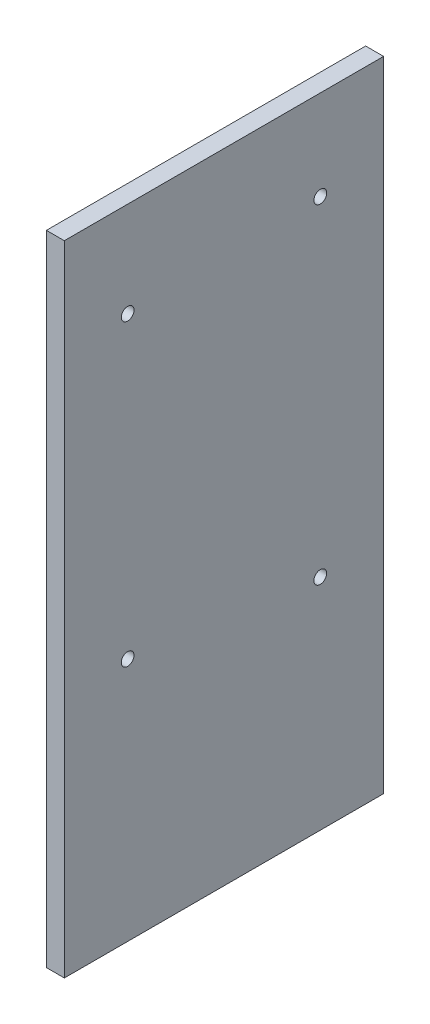
ISO-10303-21;
HEADER;
FILE_DESCRIPTION(('STEP AP214'),'2;1');
FILE_NAME('part.step','',(''),(''),'','','');
FILE_SCHEMA(('AUTOMOTIVE_DESIGN { 1 0 10303 214 1 1 1 1 }'));
ENDSEC;
DATA;
#1=APPLICATION_CONTEXT('core data for automotive mechanical design processes');
#2=APPLICATION_PROTOCOL_DEFINITION('international standard','automotive_design',2000,#1);
#3=PRODUCT_CONTEXT('',#1,'mechanical');
#4=PRODUCT('Part','Part','',(#3));
#5=PRODUCT_RELATED_PRODUCT_CATEGORY('part','',(#4));
#6=PRODUCT_DEFINITION_FORMATION('','',#4);
#7=PRODUCT_DEFINITION_CONTEXT('part definition',#1,'design');
#8=PRODUCT_DEFINITION('design','',#6,#7);
#9=PRODUCT_DEFINITION_SHAPE('','',#8);
#10=(LENGTH_UNIT() NAMED_UNIT(*) SI_UNIT(.MILLI.,.METRE.));
#11=(NAMED_UNIT(*) PLANE_ANGLE_UNIT() SI_UNIT($,.RADIAN.));
#12=(NAMED_UNIT(*) SI_UNIT($,.STERADIAN.) SOLID_ANGLE_UNIT());
#13=UNCERTAINTY_MEASURE_WITH_UNIT(LENGTH_MEASURE(1.E-05),#10,'distance_accuracy_value','');
#14=(GEOMETRIC_REPRESENTATION_CONTEXT(3) GLOBAL_UNCERTAINTY_ASSIGNED_CONTEXT((#13)) GLOBAL_UNIT_ASSIGNED_CONTEXT((#10,
#11,#12)) REPRESENTATION_CONTEXT('',''));
#15=CARTESIAN_POINT('',(0.,0.,0.));
#16=DIRECTION('',(0.,0.,1.));
#17=DIRECTION('',(1.,0.,0.));
#18=AXIS2_PLACEMENT_3D('',#15,#16,#17);
#19=CARTESIAN_POINT('',(4.5,-80.,-40.));
#20=DIRECTION('',(0.,0.,1.));
#21=DIRECTION('',(1.,0.,0.));
#22=AXIS2_PLACEMENT_3D('',#19,#20,#21);
#23=PLANE('',#22);
#24=DIRECTION('',(0.,1.,0.));
#25=VECTOR('',#24,1.);
#26=CARTESIAN_POINT('',(0.,-80.,-40.));
#27=LINE('',#26,#25);
#28=CARTESIAN_POINT('',(0.,-80.,-40.));
#29=VERTEX_POINT('',#28);
#30=CARTESIAN_POINT('',(0.,80.,-40.));
#31=VERTEX_POINT('',#30);
#32=EDGE_CURVE('E98',#29,#31,#27,.T.);
#33=ORIENTED_EDGE('',*,*,#32,.T.);
#34=DIRECTION('',(-1.,0.,0.));
#35=VECTOR('',#34,1.);
#36=CARTESIAN_POINT('',(4.5,80.,-40.));
#37=LINE('',#36,#35);
#38=CARTESIAN_POINT('',(4.5,80.,-40.));
#39=VERTEX_POINT('',#38);
#40=EDGE_CURVE('E11',#39,#31,#37,.T.);
#41=ORIENTED_EDGE('',*,*,#40,.F.);
#42=DIRECTION('',(0.,1.,0.));
#43=VECTOR('',#42,1.);
#44=CARTESIAN_POINT('',(4.5,-80.,-40.));
#45=LINE('',#44,#43);
#46=CARTESIAN_POINT('',(4.5,-80.,-40.));
#47=VERTEX_POINT('',#46);
#48=EDGE_CURVE('E86',#47,#39,#45,.T.);
#49=ORIENTED_EDGE('',*,*,#48,.F.);
#50=DIRECTION('',(-1.,0.,0.));
#51=VECTOR('',#50,1.);
#52=CARTESIAN_POINT('',(4.5,-80.,-40.));
#53=LINE('',#52,#51);
#54=EDGE_CURVE('E94',#47,#29,#53,.T.);
#55=ORIENTED_EDGE('',*,*,#54,.T.);
#56=EDGE_LOOP('',(#33,#41,#49,#55));
#57=FACE_BOUND('',#56,.T.);
#58=ADVANCED_FACE('F35',(#57),#23,.F.);
#59=CARTESIAN_POINT('',(4.5,80.,40.));
#60=DIRECTION('',(0.,-1.,0.));
#61=DIRECTION('',(0.,0.,-1.));
#62=AXIS2_PLACEMENT_3D('',#59,#60,#61);
#63=PLANE('',#62);
#64=DIRECTION('',(0.,0.,1.));
#65=VECTOR('',#64,1.);
#66=CARTESIAN_POINT('',(0.,80.,40.));
#67=LINE('',#66,#65);
#68=CARTESIAN_POINT('',(0.,80.,40.));
#69=VERTEX_POINT('',#68);
#70=EDGE_CURVE('E90',#31,#69,#67,.T.);
#71=ORIENTED_EDGE('',*,*,#70,.T.);
#72=DIRECTION('',(-1.,0.,0.));
#73=VECTOR('',#72,1.);
#74=CARTESIAN_POINT('',(4.5,80.,40.));
#75=LINE('',#74,#73);
#76=CARTESIAN_POINT('',(4.5,80.,40.));
#77=VERTEX_POINT('',#76);
#78=EDGE_CURVE('E43',#77,#69,#75,.T.);
#79=ORIENTED_EDGE('',*,*,#78,.F.);
#80=DIRECTION('',(0.,0.,1.));
#81=VECTOR('',#80,1.);
#82=CARTESIAN_POINT('',(4.5,80.,40.));
#83=LINE('',#82,#81);
#84=EDGE_CURVE('E81',#39,#77,#83,.T.);
#85=ORIENTED_EDGE('',*,*,#84,.F.);
#86=ORIENTED_EDGE('',*,*,#40,.T.);
#87=EDGE_LOOP('',(#71,#79,#85,#86));
#88=FACE_BOUND('',#87,.T.);
#89=ADVANCED_FACE('F89',(#88),#63,.F.);
#90=CARTESIAN_POINT('',(4.5,-80.,40.));
#91=DIRECTION('',(0.,0.,-1.));
#92=DIRECTION('',(-1.,0.,0.));
#93=AXIS2_PLACEMENT_3D('',#90,#91,#92);
#94=PLANE('',#93);
#95=DIRECTION('',(0.,-1.,0.));
#96=VECTOR('',#95,1.);
#97=CARTESIAN_POINT('',(0.,-80.,40.));
#98=LINE('',#97,#96);
#99=CARTESIAN_POINT('',(0.,-80.,40.));
#100=VERTEX_POINT('',#99);
#101=EDGE_CURVE('E68',#69,#100,#98,.T.);
#102=ORIENTED_EDGE('',*,*,#101,.T.);
#103=DIRECTION('',(-1.,0.,0.));
#104=VECTOR('',#103,1.);
#105=CARTESIAN_POINT('',(4.5,-80.,40.));
#106=LINE('',#105,#104);
#107=CARTESIAN_POINT('',(4.5,-80.,40.));
#108=VERTEX_POINT('',#107);
#109=EDGE_CURVE('E91',#108,#100,#106,.T.);
#110=ORIENTED_EDGE('',*,*,#109,.F.);
#111=DIRECTION('',(0.,-1.,0.));
#112=VECTOR('',#111,1.);
#113=CARTESIAN_POINT('',(4.5,-80.,40.));
#114=LINE('',#113,#112);
#115=EDGE_CURVE('E84',#77,#108,#114,.T.);
#116=ORIENTED_EDGE('',*,*,#115,.F.);
#117=ORIENTED_EDGE('',*,*,#78,.T.);
#118=EDGE_LOOP('',(#102,#110,#116,#117));
#119=FACE_BOUND('',#118,.T.);
#120=ADVANCED_FACE('F92',(#119),#94,.F.);
#121=CARTESIAN_POINT('',(4.5,-80.,40.));
#122=DIRECTION('',(0.,1.,0.));
#123=DIRECTION('',(0.,0.,1.));
#124=AXIS2_PLACEMENT_3D('',#121,#122,#123);
#125=PLANE('',#124);
#126=DIRECTION('',(0.,0.,-1.));
#127=VECTOR('',#126,1.);
#128=CARTESIAN_POINT('',(0.,-80.,40.));
#129=LINE('',#128,#127);
#130=EDGE_CURVE('E74',#100,#29,#129,.T.);
#131=ORIENTED_EDGE('',*,*,#130,.T.);
#132=ORIENTED_EDGE('',*,*,#54,.F.);
#133=DIRECTION('',(0.,0.,-1.));
#134=VECTOR('',#133,1.);
#135=CARTESIAN_POINT('',(4.5,-80.,40.));
#136=LINE('',#135,#134);
#137=EDGE_CURVE('E51',#108,#47,#136,.T.);
#138=ORIENTED_EDGE('',*,*,#137,.F.);
#139=ORIENTED_EDGE('',*,*,#109,.T.);
#140=EDGE_LOOP('',(#131,#132,#138,#139));
#141=FACE_BOUND('',#140,.T.);
#142=ADVANCED_FACE('F106',(#141),#125,.F.);
#143=CARTESIAN_POINT('',(4.5,0.,0.));
#144=DIRECTION('',(-1.,0.,0.));
#145=DIRECTION('',(0.,0.,1.));
#146=AXIS2_PLACEMENT_3D('',#143,#144,#145);
#147=PLANE('',#146);
#148=CARTESIAN_POINT('',(4.5,-25.05,-24.12));
#149=DIRECTION('',(-1.,0.,0.));
#150=DIRECTION('',(0.,0.,1.));
#151=AXIS2_PLACEMENT_3D('',#148,#149,#150);
#152=CIRCLE('',#151,1.6);
#153=CARTESIAN_POINT('',(4.5,-25.05,-22.52));
#154=VERTEX_POINT('',#153);
#155=EDGE_CURVE('E121',#154,#154,#152,.T.);
#156=ORIENTED_EDGE('',*,*,#155,.T.);
#157=EDGE_LOOP('',(#156));
#158=FACE_BOUND('',#157,.T.);
#159=CARTESIAN_POINT('',(4.5,-18.7,24.14));
#160=DIRECTION('',(-1.,0.,0.));
#161=DIRECTION('',(0.,0.,1.));
#162=AXIS2_PLACEMENT_3D('',#159,#160,#161);
#163=CIRCLE('',#162,1.6);
#164=CARTESIAN_POINT('',(4.5,-18.7,25.74));
#165=VERTEX_POINT('',#164);
#166=EDGE_CURVE('E127',#165,#165,#163,.T.);
#167=ORIENTED_EDGE('',*,*,#166,.T.);
#168=EDGE_LOOP('',(#167));
#169=FACE_BOUND('',#168,.T.);
#170=CARTESIAN_POINT('',(4.5,56.23,24.14));
#171=DIRECTION('',(-1.,0.,0.));
#172=DIRECTION('',(0.,0.,1.));
#173=AXIS2_PLACEMENT_3D('',#170,#171,#172);
#174=CIRCLE('',#173,1.60000000000001);
#175=CARTESIAN_POINT('',(4.5,56.23,25.74));
#176=VERTEX_POINT('',#175);
#177=EDGE_CURVE('E115',#176,#176,#174,.T.);
#178=ORIENTED_EDGE('',*,*,#177,.T.);
#179=EDGE_LOOP('',(#178));
#180=FACE_BOUND('',#179,.T.);
#181=CARTESIAN_POINT('',(4.5,57.5,-24.14));
#182=DIRECTION('',(-1.,0.,0.));
#183=DIRECTION('',(0.,0.,1.));
#184=AXIS2_PLACEMENT_3D('',#181,#182,#183);
#185=CIRCLE('',#184,1.60000000000001);
#186=CARTESIAN_POINT('',(4.5,57.5,-22.54));
#187=VERTEX_POINT('',#186);
#188=EDGE_CURVE('E101',#187,#187,#185,.T.);
#189=ORIENTED_EDGE('',*,*,#188,.T.);
#190=EDGE_LOOP('',(#189));
#191=FACE_BOUND('',#190,.T.);
#192=ORIENTED_EDGE('',*,*,#48,.T.);
#193=ORIENTED_EDGE('',*,*,#84,.T.);
#194=ORIENTED_EDGE('',*,*,#115,.T.);
#195=ORIENTED_EDGE('',*,*,#137,.T.);
#196=EDGE_LOOP('',(#192,#193,#194,#195));
#197=FACE_BOUND('',#196,.T.);
#198=ADVANCED_FACE('F82',(#158,#169,#180,#191,#197),#147,.F.);
#199=CARTESIAN_POINT('',(0.,0.,0.));
#200=DIRECTION('',(-1.,0.,0.));
#201=DIRECTION('',(0.,0.,1.));
#202=AXIS2_PLACEMENT_3D('',#199,#200,#201);
#203=PLANE('',#202);
#204=CARTESIAN_POINT('',(0.,-25.05,-24.12));
#205=DIRECTION('',(-1.,0.,0.));
#206=DIRECTION('',(0.,0.,1.));
#207=AXIS2_PLACEMENT_3D('',#204,#205,#206);
#208=CIRCLE('',#207,1.6);
#209=CARTESIAN_POINT('',(0.,-25.05,-22.52));
#210=VERTEX_POINT('',#209);
#211=EDGE_CURVE('E118',#210,#210,#208,.T.);
#212=ORIENTED_EDGE('',*,*,#211,.F.);
#213=EDGE_LOOP('',(#212));
#214=FACE_BOUND('',#213,.T.);
#215=CARTESIAN_POINT('',(0.,-18.7,24.14));
#216=DIRECTION('',(-1.,0.,0.));
#217=DIRECTION('',(0.,0.,1.));
#218=AXIS2_PLACEMENT_3D('',#215,#216,#217);
#219=CIRCLE('',#218,1.6);
#220=CARTESIAN_POINT('',(0.,-18.7,25.74));
#221=VERTEX_POINT('',#220);
#222=EDGE_CURVE('E124',#221,#221,#219,.T.);
#223=ORIENTED_EDGE('',*,*,#222,.F.);
#224=EDGE_LOOP('',(#223));
#225=FACE_BOUND('',#224,.T.);
#226=CARTESIAN_POINT('',(0.,56.23,24.14));
#227=DIRECTION('',(-1.,0.,0.));
#228=DIRECTION('',(0.,0.,1.));
#229=AXIS2_PLACEMENT_3D('',#226,#227,#228);
#230=CIRCLE('',#229,1.60000000000001);
#231=CARTESIAN_POINT('',(0.,56.23,25.74));
#232=VERTEX_POINT('',#231);
#233=EDGE_CURVE('E130',#232,#232,#230,.T.);
#234=ORIENTED_EDGE('',*,*,#233,.F.);
#235=EDGE_LOOP('',(#234));
#236=FACE_BOUND('',#235,.T.);
#237=CARTESIAN_POINT('',(0.,57.5,-24.14));
#238=DIRECTION('',(-1.,0.,0.));
#239=DIRECTION('',(0.,0.,1.));
#240=AXIS2_PLACEMENT_3D('',#237,#238,#239);
#241=CIRCLE('',#240,1.60000000000001);
#242=CARTESIAN_POINT('',(0.,57.5,-22.54));
#243=VERTEX_POINT('',#242);
#244=EDGE_CURVE('E112',#243,#243,#241,.T.);
#245=ORIENTED_EDGE('',*,*,#244,.F.);
#246=EDGE_LOOP('',(#245));
#247=FACE_BOUND('',#246,.T.);
#248=ORIENTED_EDGE('',*,*,#32,.F.);
#249=ORIENTED_EDGE('',*,*,#130,.F.);
#250=ORIENTED_EDGE('',*,*,#101,.F.);
#251=ORIENTED_EDGE('',*,*,#70,.F.);
#252=EDGE_LOOP('',(#248,#249,#250,#251));
#253=FACE_BOUND('',#252,.T.);
#254=ADVANCED_FACE('F109',(#214,#225,#236,#247,#253),#203,.T.);
#255=CARTESIAN_POINT('',(4.5,57.5,-24.14));
#256=DIRECTION('',(-1.,0.,0.));
#257=DIRECTION('',(0.,0.,1.));
#258=AXIS2_PLACEMENT_3D('',#255,#256,#257);
#259=CYLINDRICAL_SURFACE('',#258,1.60000000000001);
#260=ORIENTED_EDGE('',*,*,#188,.F.);
#261=EDGE_LOOP('',(#260));
#262=FACE_BOUND('',#261,.T.);
#263=ORIENTED_EDGE('',*,*,#244,.T.);
#264=EDGE_LOOP('',(#263));
#265=FACE_BOUND('',#264,.T.);
#266=ADVANCED_FACE('F142',(#262,#265),#259,.F.);
#267=CARTESIAN_POINT('',(4.5,56.23,24.14));
#268=DIRECTION('',(-1.,0.,0.));
#269=DIRECTION('',(0.,0.,1.));
#270=AXIS2_PLACEMENT_3D('',#267,#268,#269);
#271=CYLINDRICAL_SURFACE('',#270,1.60000000000001);
#272=ORIENTED_EDGE('',*,*,#177,.F.);
#273=EDGE_LOOP('',(#272));
#274=FACE_BOUND('',#273,.T.);
#275=ORIENTED_EDGE('',*,*,#233,.T.);
#276=EDGE_LOOP('',(#275));
#277=FACE_BOUND('',#276,.T.);
#278=ADVANCED_FACE('F138',(#274,#277),#271,.F.);
#279=CARTESIAN_POINT('',(4.5,-18.7,24.14));
#280=DIRECTION('',(-1.,0.,0.));
#281=DIRECTION('',(0.,0.,1.));
#282=AXIS2_PLACEMENT_3D('',#279,#280,#281);
#283=CYLINDRICAL_SURFACE('',#282,1.6);
#284=ORIENTED_EDGE('',*,*,#166,.F.);
#285=EDGE_LOOP('',(#284));
#286=FACE_BOUND('',#285,.T.);
#287=ORIENTED_EDGE('',*,*,#222,.T.);
#288=EDGE_LOOP('',(#287));
#289=FACE_BOUND('',#288,.T.);
#290=ADVANCED_FACE('F141',(#286,#289),#283,.F.);
#291=CARTESIAN_POINT('',(4.5,-25.05,-24.12));
#292=DIRECTION('',(-1.,0.,0.));
#293=DIRECTION('',(0.,0.,1.));
#294=AXIS2_PLACEMENT_3D('',#291,#292,#293);
#295=CYLINDRICAL_SURFACE('',#294,1.6);
#296=ORIENTED_EDGE('',*,*,#155,.F.);
#297=EDGE_LOOP('',(#296));
#298=FACE_BOUND('',#297,.T.);
#299=ORIENTED_EDGE('',*,*,#211,.T.);
#300=EDGE_LOOP('',(#299));
#301=FACE_BOUND('',#300,.T.);
#302=ADVANCED_FACE('F180',(#298,#301),#295,.F.);
#303=CLOSED_SHELL('',(#58,#89,#120,#142,#198,#254,#266,#278,#290,#302));
#304=MANIFOLD_SOLID_BREP('B2',#303);
#305=ADVANCED_BREP_SHAPE_REPRESENTATION('',(#18,#304),#14);
#306=SHAPE_DEFINITION_REPRESENTATION(#9,#305);
ENDSEC;
END-ISO-10303-21;
